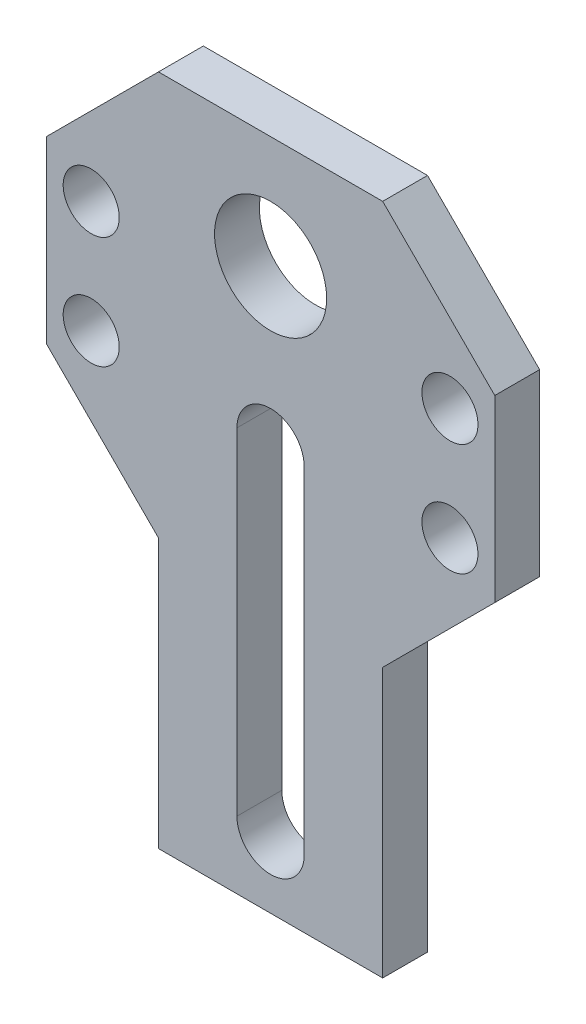
ISO-10303-21;
HEADER;
FILE_DESCRIPTION(('STEP AP214'),'2;1');
FILE_NAME('part.step','',(''),(''),'','','');
FILE_SCHEMA(('AUTOMOTIVE_DESIGN { 1 0 10303 214 1 1 1 1 }'));
ENDSEC;
DATA;
#1=APPLICATION_CONTEXT('core data for automotive mechanical design processes');
#2=APPLICATION_PROTOCOL_DEFINITION('international standard','automotive_design',2000,#1);
#3=PRODUCT_CONTEXT('',#1,'mechanical');
#4=PRODUCT('Part','Part','',(#3));
#5=PRODUCT_RELATED_PRODUCT_CATEGORY('part','',(#4));
#6=PRODUCT_DEFINITION_FORMATION('','',#4);
#7=PRODUCT_DEFINITION_CONTEXT('part definition',#1,'design');
#8=PRODUCT_DEFINITION('design','',#6,#7);
#9=PRODUCT_DEFINITION_SHAPE('','',#8);
#10=(LENGTH_UNIT() NAMED_UNIT(*) SI_UNIT(.MILLI.,.METRE.));
#11=(NAMED_UNIT(*) PLANE_ANGLE_UNIT() SI_UNIT($,.RADIAN.));
#12=(NAMED_UNIT(*) SI_UNIT($,.STERADIAN.) SOLID_ANGLE_UNIT());
#13=UNCERTAINTY_MEASURE_WITH_UNIT(LENGTH_MEASURE(1.E-05),#10,'distance_accuracy_value','');
#14=(GEOMETRIC_REPRESENTATION_CONTEXT(3) GLOBAL_UNCERTAINTY_ASSIGNED_CONTEXT((#13)) GLOBAL_UNIT_ASSIGNED_CONTEXT((#10,
#11,#12)) REPRESENTATION_CONTEXT('',''));
#15=CARTESIAN_POINT('',(0.,0.,0.));
#16=DIRECTION('',(0.,0.,1.));
#17=DIRECTION('',(1.,0.,0.));
#18=AXIS2_PLACEMENT_3D('',#15,#16,#17);
#19=CARTESIAN_POINT('',(0.,0.,2.));
#20=DIRECTION('',(1.,0.,0.));
#21=DIRECTION('',(0.,0.,-1.));
#22=AXIS2_PLACEMENT_3D('',#19,#20,#21);
#23=PLANE('',#22);
#24=DIRECTION('',(0.,0.,1.));
#25=VECTOR('',#24,1.);
#26=CARTESIAN_POINT('',(0.,12.,0.));
#27=LINE('',#26,#25);
#28=CARTESIAN_POINT('',(0.,12.,0.));
#29=VERTEX_POINT('',#28);
#30=CARTESIAN_POINT('',(0.,12.,2.));
#31=VERTEX_POINT('',#30);
#32=EDGE_CURVE('E62',#29,#31,#27,.T.);
#33=ORIENTED_EDGE('',*,*,#32,.F.);
#34=DIRECTION('',(0.,-1.,0.));
#35=VECTOR('',#34,1.);
#36=CARTESIAN_POINT('',(0.,0.,0.));
#37=LINE('',#36,#35);
#38=CARTESIAN_POINT('',(0.,0.,0.));
#39=VERTEX_POINT('',#38);
#40=EDGE_CURVE('E173',#29,#39,#37,.T.);
#41=ORIENTED_EDGE('',*,*,#40,.T.);
#42=DIRECTION('',(0.,0.,-1.));
#43=VECTOR('',#42,1.);
#44=CARTESIAN_POINT('',(0.,0.,2.));
#45=LINE('',#44,#43);
#46=CARTESIAN_POINT('',(0.,0.,2.));
#47=VERTEX_POINT('',#46);
#48=EDGE_CURVE('E11',#47,#39,#45,.T.);
#49=ORIENTED_EDGE('',*,*,#48,.F.);
#50=DIRECTION('',(0.,-1.,0.));
#51=VECTOR('',#50,1.);
#52=CARTESIAN_POINT('',(0.,0.,2.));
#53=LINE('',#52,#51);
#54=EDGE_CURVE('E171',#31,#47,#53,.T.);
#55=ORIENTED_EDGE('',*,*,#54,.F.);
#56=EDGE_LOOP('',(#33,#41,#49,#55));
#57=FACE_BOUND('',#56,.T.);
#58=ADVANCED_FACE('F39',(#57),#23,.F.);
#59=CARTESIAN_POINT('',(0.,0.,2.));
#60=DIRECTION('',(0.,1.,0.));
#61=DIRECTION('',(0.,0.,1.));
#62=AXIS2_PLACEMENT_3D('',#59,#60,#61);
#63=PLANE('',#62);
#64=DIRECTION('',(1.,0.,0.));
#65=VECTOR('',#64,1.);
#66=CARTESIAN_POINT('',(0.,0.,0.));
#67=LINE('',#66,#65);
#68=CARTESIAN_POINT('',(10.,0.,0.));
#69=VERTEX_POINT('',#68);
#70=EDGE_CURVE('E167',#39,#69,#67,.T.);
#71=ORIENTED_EDGE('',*,*,#70,.T.);
#72=DIRECTION('',(0.,0.,-1.));
#73=VECTOR('',#72,1.);
#74=CARTESIAN_POINT('',(10.,0.,2.));
#75=LINE('',#74,#73);
#76=CARTESIAN_POINT('',(10.,0.,2.));
#77=VERTEX_POINT('',#76);
#78=EDGE_CURVE('E47',#77,#69,#75,.T.);
#79=ORIENTED_EDGE('',*,*,#78,.F.);
#80=DIRECTION('',(1.,0.,0.));
#81=VECTOR('',#80,1.);
#82=CARTESIAN_POINT('',(0.,0.,2.));
#83=LINE('',#82,#81);
#84=EDGE_CURVE('E191',#47,#77,#83,.T.);
#85=ORIENTED_EDGE('',*,*,#84,.F.);
#86=ORIENTED_EDGE('',*,*,#48,.T.);
#87=EDGE_LOOP('',(#71,#79,#85,#86));
#88=FACE_BOUND('',#87,.T.);
#89=ADVANCED_FACE('F379',(#88),#63,.F.);
#90=CARTESIAN_POINT('',(10.,0.,2.));
#91=DIRECTION('',(-1.,0.,0.));
#92=DIRECTION('',(0.,0.,1.));
#93=AXIS2_PLACEMENT_3D('',#90,#91,#92);
#94=PLANE('',#93);
#95=DIRECTION('',(0.,1.,0.));
#96=VECTOR('',#95,1.);
#97=CARTESIAN_POINT('',(10.,0.,0.));
#98=LINE('',#97,#96);
#99=CARTESIAN_POINT('',(10.,12.,0.));
#100=VERTEX_POINT('',#99);
#101=EDGE_CURVE('E155',#69,#100,#98,.T.);
#102=ORIENTED_EDGE('',*,*,#101,.T.);
#103=DIRECTION('',(0.,0.,1.));
#104=VECTOR('',#103,1.);
#105=CARTESIAN_POINT('',(10.,12.,0.));
#106=LINE('',#105,#104);
#107=CARTESIAN_POINT('',(10.,12.,2.));
#108=VERTEX_POINT('',#107);
#109=EDGE_CURVE('E138',#100,#108,#106,.T.);
#110=ORIENTED_EDGE('',*,*,#109,.T.);
#111=DIRECTION('',(0.,1.,0.));
#112=VECTOR('',#111,1.);
#113=CARTESIAN_POINT('',(10.,0.,2.));
#114=LINE('',#113,#112);
#115=EDGE_CURVE('E188',#77,#108,#114,.T.);
#116=ORIENTED_EDGE('',*,*,#115,.F.);
#117=ORIENTED_EDGE('',*,*,#78,.T.);
#118=EDGE_LOOP('',(#102,#110,#116,#117));
#119=FACE_BOUND('',#118,.T.);
#120=ADVANCED_FACE('F163',(#119),#94,.F.);
#121=CARTESIAN_POINT('',(0.,30.,2.));
#122=DIRECTION('',(0.,-1.,0.));
#123=DIRECTION('',(0.,0.,-1.));
#124=AXIS2_PLACEMENT_3D('',#121,#122,#123);
#125=PLANE('',#124);
#126=DIRECTION('',(-1.,0.,0.));
#127=VECTOR('',#126,1.);
#128=CARTESIAN_POINT('',(0.,30.,0.));
#129=LINE('',#128,#127);
#130=CARTESIAN_POINT('',(10.,30.,0.));
#131=VERTEX_POINT('',#130);
#132=CARTESIAN_POINT('',(0.,30.,0.));
#133=VERTEX_POINT('',#132);
#134=EDGE_CURVE('E166',#131,#133,#129,.T.);
#135=ORIENTED_EDGE('',*,*,#134,.T.);
#136=DIRECTION('',(0.,0.,-1.));
#137=VECTOR('',#136,1.);
#138=CARTESIAN_POINT('',(0.,30.,2.));
#139=LINE('',#138,#137);
#140=CARTESIAN_POINT('',(0.,30.,2.));
#141=VERTEX_POINT('',#140);
#142=EDGE_CURVE('E177',#141,#133,#139,.T.);
#143=ORIENTED_EDGE('',*,*,#142,.F.);
#144=DIRECTION('',(-1.,0.,0.));
#145=VECTOR('',#144,1.);
#146=CARTESIAN_POINT('',(0.,30.,2.));
#147=LINE('',#146,#145);
#148=CARTESIAN_POINT('',(10.,30.,2.));
#149=VERTEX_POINT('',#148);
#150=EDGE_CURVE('E182',#149,#141,#147,.T.);
#151=ORIENTED_EDGE('',*,*,#150,.F.);
#152=DIRECTION('',(0.,0.,-1.));
#153=VECTOR('',#152,1.);
#154=CARTESIAN_POINT('',(10.,30.,2.));
#155=LINE('',#154,#153);
#156=EDGE_CURVE('E181',#149,#131,#155,.T.);
#157=ORIENTED_EDGE('',*,*,#156,.T.);
#158=EDGE_LOOP('',(#135,#143,#151,#157));
#159=FACE_BOUND('',#158,.T.);
#160=ADVANCED_FACE('F351',(#159),#125,.F.);
#161=CARTESIAN_POINT('',(0.,0.,2.));
#162=DIRECTION('',(0.,0.,-1.));
#163=DIRECTION('',(-1.,0.,0.));
#164=AXIS2_PLACEMENT_3D('',#161,#162,#163);
#165=PLANE('',#164);
#166=CARTESIAN_POINT('',(13.,23.5,2.));
#167=DIRECTION('',(0.,0.,1.));
#168=DIRECTION('',(-1.,0.,0.));
#169=AXIS2_PLACEMENT_3D('',#166,#167,#168);
#170=CIRCLE('',#169,1.25);
#171=CARTESIAN_POINT('',(11.75,23.5,2.));
#172=VERTEX_POINT('',#171);
#173=EDGE_CURVE('E314',#172,#172,#170,.T.);
#174=ORIENTED_EDGE('',*,*,#173,.F.);
#175=EDGE_LOOP('',(#174));
#176=FACE_BOUND('',#175,.T.);
#177=CARTESIAN_POINT('',(13.,18.5,2.));
#178=DIRECTION('',(0.,0.,1.));
#179=DIRECTION('',(-1.,0.,0.));
#180=AXIS2_PLACEMENT_3D('',#177,#178,#179);
#181=CIRCLE('',#180,1.25);
#182=CARTESIAN_POINT('',(11.75,18.5,2.));
#183=VERTEX_POINT('',#182);
#184=EDGE_CURVE('E322',#183,#183,#181,.T.);
#185=ORIENTED_EDGE('',*,*,#184,.F.);
#186=EDGE_LOOP('',(#185));
#187=FACE_BOUND('',#186,.T.);
#188=CARTESIAN_POINT('',(-3.,18.5,2.));
#189=DIRECTION('',(0.,0.,1.));
#190=DIRECTION('',(1.,0.,0.));
#191=AXIS2_PLACEMENT_3D('',#188,#189,#190);
#192=CIRCLE('',#191,1.25);
#193=CARTESIAN_POINT('',(-1.75,18.5,2.));
#194=VERTEX_POINT('',#193);
#195=EDGE_CURVE('E330',#194,#194,#192,.T.);
#196=ORIENTED_EDGE('',*,*,#195,.F.);
#197=EDGE_LOOP('',(#196));
#198=FACE_BOUND('',#197,.T.);
#199=CARTESIAN_POINT('',(-3.,23.5,2.));
#200=DIRECTION('',(0.,0.,1.));
#201=DIRECTION('',(1.,0.,0.));
#202=AXIS2_PLACEMENT_3D('',#199,#200,#201);
#203=CIRCLE('',#202,1.25);
#204=CARTESIAN_POINT('',(-1.75,23.5,2.));
#205=VERTEX_POINT('',#204);
#206=EDGE_CURVE('E306',#205,#205,#203,.T.);
#207=ORIENTED_EDGE('',*,*,#206,.F.);
#208=EDGE_LOOP('',(#207));
#209=FACE_BOUND('',#208,.T.);
#210=DIRECTION('',(0.,1.,0.));
#211=VECTOR('',#210,1.);
#212=CARTESIAN_POINT('',(6.5,3.,2.));
#213=LINE('',#212,#211);
#214=CARTESIAN_POINT('',(6.5,3.,2.));
#215=VERTEX_POINT('',#214);
#216=CARTESIAN_POINT('',(6.5,18.,2.));
#217=VERTEX_POINT('',#216);
#218=EDGE_CURVE('E235',#215,#217,#213,.T.);
#219=ORIENTED_EDGE('',*,*,#218,.F.);
#220=CARTESIAN_POINT('',(5.,3.,2.));
#221=DIRECTION('',(0.,0.,1.));
#222=DIRECTION('',(1.,0.,0.));
#223=AXIS2_PLACEMENT_3D('',#220,#221,#222);
#224=CIRCLE('',#223,1.5);
#225=CARTESIAN_POINT('',(3.5,3.,2.));
#226=VERTEX_POINT('',#225);
#227=EDGE_CURVE('E239',#226,#215,#224,.T.);
#228=ORIENTED_EDGE('',*,*,#227,.F.);
#229=DIRECTION('',(0.,-1.,0.));
#230=VECTOR('',#229,1.);
#231=CARTESIAN_POINT('',(3.5,3.,2.));
#232=LINE('',#231,#230);
#233=CARTESIAN_POINT('',(3.5,18.,2.));
#234=VERTEX_POINT('',#233);
#235=EDGE_CURVE('E226',#234,#226,#232,.T.);
#236=ORIENTED_EDGE('',*,*,#235,.F.);
#237=CARTESIAN_POINT('',(5.,18.,2.));
#238=DIRECTION('',(0.,0.,1.));
#239=DIRECTION('',(1.,0.,0.));
#240=AXIS2_PLACEMENT_3D('',#237,#238,#239);
#241=CIRCLE('',#240,1.5);
#242=EDGE_CURVE('E231',#217,#234,#241,.T.);
#243=ORIENTED_EDGE('',*,*,#242,.F.);
#244=EDGE_LOOP('',(#219,#228,#236,#243));
#245=FACE_BOUND('',#244,.T.);
#246=CARTESIAN_POINT('',(5.,25.,2.));
#247=DIRECTION('',(0.,0.,1.));
#248=DIRECTION('',(1.,0.,0.));
#249=AXIS2_PLACEMENT_3D('',#246,#247,#248);
#250=CIRCLE('',#249,2.5);
#251=CARTESIAN_POINT('',(7.5,25.,2.));
#252=VERTEX_POINT('',#251);
#253=EDGE_CURVE('E200',#252,#252,#250,.T.);
#254=ORIENTED_EDGE('',*,*,#253,.F.);
#255=EDGE_LOOP('',(#254));
#256=FACE_BOUND('',#255,.T.);
#257=ORIENTED_EDGE('',*,*,#150,.T.);
#258=DIRECTION('',(-0.707106781186549,-0.707106781186546,0.));
#259=VECTOR('',#258,1.);
#260=CARTESIAN_POINT('',(0.,30.,2.));
#261=LINE('',#260,#259);
#262=CARTESIAN_POINT('',(-5.,25.,2.));
#263=VERTEX_POINT('',#262);
#264=EDGE_CURVE('E273',#141,#263,#261,.T.);
#265=ORIENTED_EDGE('',*,*,#264,.T.);
#266=DIRECTION('',(0.,-1.,0.));
#267=VECTOR('',#266,1.);
#268=CARTESIAN_POINT('',(-5.,25.,2.));
#269=LINE('',#268,#267);
#270=CARTESIAN_POINT('',(-5.,17.,2.));
#271=VERTEX_POINT('',#270);
#272=EDGE_CURVE('E269',#263,#271,#269,.T.);
#273=ORIENTED_EDGE('',*,*,#272,.T.);
#274=DIRECTION('',(0.707106781186549,-0.707106781186546,0.));
#275=VECTOR('',#274,1.);
#276=CARTESIAN_POINT('',(-5.,17.,2.));
#277=LINE('',#276,#275);
#278=EDGE_CURVE('E265',#271,#31,#277,.T.);
#279=ORIENTED_EDGE('',*,*,#278,.T.);
#280=ORIENTED_EDGE('',*,*,#54,.T.);
#281=ORIENTED_EDGE('',*,*,#84,.T.);
#282=ORIENTED_EDGE('',*,*,#115,.T.);
#283=DIRECTION('',(0.707106781186548,0.707106781186547,0.));
#284=VECTOR('',#283,1.);
#285=CARTESIAN_POINT('',(15.,17.,2.));
#286=LINE('',#285,#284);
#287=CARTESIAN_POINT('',(15.,17.,2.));
#288=VERTEX_POINT('',#287);
#289=EDGE_CURVE('E54',#108,#288,#286,.T.);
#290=ORIENTED_EDGE('',*,*,#289,.T.);
#291=DIRECTION('',(0.,1.,0.));
#292=VECTOR('',#291,1.);
#293=CARTESIAN_POINT('',(15.,25.,2.));
#294=LINE('',#293,#292);
#295=CARTESIAN_POINT('',(15.,25.,2.));
#296=VERTEX_POINT('',#295);
#297=EDGE_CURVE('E295',#288,#296,#294,.T.);
#298=ORIENTED_EDGE('',*,*,#297,.T.);
#299=DIRECTION('',(-0.707106781186549,0.707106781186546,0.));
#300=VECTOR('',#299,1.);
#301=CARTESIAN_POINT('',(10.,30.,2.));
#302=LINE('',#301,#300);
#303=EDGE_CURVE('E160',#296,#149,#302,.T.);
#304=ORIENTED_EDGE('',*,*,#303,.T.);
#305=EDGE_LOOP('',(#257,#265,#273,#279,#280,#281,#282,#290,#298,#304));
#306=FACE_BOUND('',#305,.T.);
#307=ADVANCED_FACE('F348',(#176,#187,#198,#209,#245,#256,#306),#165,.F.);
#308=CARTESIAN_POINT('',(0.,0.,0.));
#309=DIRECTION('',(0.,0.,-1.));
#310=DIRECTION('',(-1.,0.,0.));
#311=AXIS2_PLACEMENT_3D('',#308,#309,#310);
#312=PLANE('',#311);
#313=CARTESIAN_POINT('',(13.,23.5,0.));
#314=DIRECTION('',(0.,0.,1.));
#315=DIRECTION('',(-1.,0.,0.));
#316=AXIS2_PLACEMENT_3D('',#313,#314,#315);
#317=CIRCLE('',#316,1.25);
#318=CARTESIAN_POINT('',(11.75,23.5,0.));
#319=VERTEX_POINT('',#318);
#320=EDGE_CURVE('E318',#319,#319,#317,.T.);
#321=ORIENTED_EDGE('',*,*,#320,.T.);
#322=EDGE_LOOP('',(#321));
#323=FACE_BOUND('',#322,.T.);
#324=CARTESIAN_POINT('',(13.,18.5,0.));
#325=DIRECTION('',(0.,0.,1.));
#326=DIRECTION('',(-1.,0.,0.));
#327=AXIS2_PLACEMENT_3D('',#324,#325,#326);
#328=CIRCLE('',#327,1.25);
#329=CARTESIAN_POINT('',(11.75,18.5,0.));
#330=VERTEX_POINT('',#329);
#331=EDGE_CURVE('E326',#330,#330,#328,.T.);
#332=ORIENTED_EDGE('',*,*,#331,.T.);
#333=EDGE_LOOP('',(#332));
#334=FACE_BOUND('',#333,.T.);
#335=CARTESIAN_POINT('',(-3.,18.5,0.));
#336=DIRECTION('',(0.,0.,1.));
#337=DIRECTION('',(1.,0.,0.));
#338=AXIS2_PLACEMENT_3D('',#335,#336,#337);
#339=CIRCLE('',#338,1.25);
#340=CARTESIAN_POINT('',(-1.75,18.5,0.));
#341=VERTEX_POINT('',#340);
#342=EDGE_CURVE('E310',#341,#341,#339,.T.);
#343=ORIENTED_EDGE('',*,*,#342,.T.);
#344=EDGE_LOOP('',(#343));
#345=FACE_BOUND('',#344,.T.);
#346=CARTESIAN_POINT('',(-3.,23.5,0.));
#347=DIRECTION('',(0.,0.,1.));
#348=DIRECTION('',(1.,0.,0.));
#349=AXIS2_PLACEMENT_3D('',#346,#347,#348);
#350=CIRCLE('',#349,1.25);
#351=CARTESIAN_POINT('',(-1.75,23.5,0.));
#352=VERTEX_POINT('',#351);
#353=EDGE_CURVE('E301',#352,#352,#350,.T.);
#354=ORIENTED_EDGE('',*,*,#353,.T.);
#355=EDGE_LOOP('',(#354));
#356=FACE_BOUND('',#355,.T.);
#357=CARTESIAN_POINT('',(5.,3.,0.));
#358=DIRECTION('',(0.,0.,1.));
#359=DIRECTION('',(1.,0.,0.));
#360=AXIS2_PLACEMENT_3D('',#357,#358,#359);
#361=CIRCLE('',#360,1.5);
#362=CARTESIAN_POINT('',(3.5,3.,0.));
#363=VERTEX_POINT('',#362);
#364=CARTESIAN_POINT('',(6.5,3.,0.));
#365=VERTEX_POINT('',#364);
#366=EDGE_CURVE('E230',#363,#365,#361,.T.);
#367=ORIENTED_EDGE('',*,*,#366,.T.);
#368=DIRECTION('',(0.,1.,0.));
#369=VECTOR('',#368,1.);
#370=CARTESIAN_POINT('',(6.5,3.,0.));
#371=LINE('',#370,#369);
#372=CARTESIAN_POINT('',(6.5,18.,0.));
#373=VERTEX_POINT('',#372);
#374=EDGE_CURVE('E249',#365,#373,#371,.T.);
#375=ORIENTED_EDGE('',*,*,#374,.T.);
#376=CARTESIAN_POINT('',(5.,18.,0.));
#377=DIRECTION('',(0.,0.,1.));
#378=DIRECTION('',(1.,0.,0.));
#379=AXIS2_PLACEMENT_3D('',#376,#377,#378);
#380=CIRCLE('',#379,1.5);
#381=CARTESIAN_POINT('',(3.5,18.,0.));
#382=VERTEX_POINT('',#381);
#383=EDGE_CURVE('E245',#373,#382,#380,.T.);
#384=ORIENTED_EDGE('',*,*,#383,.T.);
#385=DIRECTION('',(0.,-1.,0.));
#386=VECTOR('',#385,1.);
#387=CARTESIAN_POINT('',(3.5,3.,0.));
#388=LINE('',#387,#386);
#389=EDGE_CURVE('E218',#382,#363,#388,.T.);
#390=ORIENTED_EDGE('',*,*,#389,.T.);
#391=EDGE_LOOP('',(#367,#375,#384,#390));
#392=FACE_BOUND('',#391,.T.);
#393=CARTESIAN_POINT('',(5.,25.,0.));
#394=DIRECTION('',(0.,0.,1.));
#395=DIRECTION('',(1.,0.,0.));
#396=AXIS2_PLACEMENT_3D('',#393,#394,#395);
#397=CIRCLE('',#396,2.5);
#398=CARTESIAN_POINT('',(7.5,25.,0.));
#399=VERTEX_POINT('',#398);
#400=EDGE_CURVE('E203',#399,#399,#397,.T.);
#401=ORIENTED_EDGE('',*,*,#400,.T.);
#402=EDGE_LOOP('',(#401));
#403=FACE_BOUND('',#402,.T.);
#404=ORIENTED_EDGE('',*,*,#40,.F.);
#405=DIRECTION('',(0.707106781186549,-0.707106781186546,0.));
#406=VECTOR('',#405,1.);
#407=CARTESIAN_POINT('',(-5.,17.,0.));
#408=LINE('',#407,#406);
#409=CARTESIAN_POINT('',(-5.,17.,0.));
#410=VERTEX_POINT('',#409);
#411=EDGE_CURVE('E260',#410,#29,#408,.T.);
#412=ORIENTED_EDGE('',*,*,#411,.F.);
#413=DIRECTION('',(0.,-1.,0.));
#414=VECTOR('',#413,1.);
#415=CARTESIAN_POINT('',(-5.,25.,0.));
#416=LINE('',#415,#414);
#417=CARTESIAN_POINT('',(-5.,25.,0.));
#418=VERTEX_POINT('',#417);
#419=EDGE_CURVE('E281',#418,#410,#416,.T.);
#420=ORIENTED_EDGE('',*,*,#419,.F.);
#421=DIRECTION('',(-0.707106781186549,-0.707106781186546,0.));
#422=VECTOR('',#421,1.);
#423=CARTESIAN_POINT('',(0.,30.,0.));
#424=LINE('',#423,#422);
#425=EDGE_CURVE('E268',#133,#418,#424,.T.);
#426=ORIENTED_EDGE('',*,*,#425,.F.);
#427=ORIENTED_EDGE('',*,*,#134,.F.);
#428=DIRECTION('',(-0.707106781186549,0.707106781186546,0.));
#429=VECTOR('',#428,1.);
#430=CARTESIAN_POINT('',(10.,30.,0.));
#431=LINE('',#430,#429);
#432=CARTESIAN_POINT('',(15.,25.,0.));
#433=VERTEX_POINT('',#432);
#434=EDGE_CURVE('E148',#433,#131,#431,.T.);
#435=ORIENTED_EDGE('',*,*,#434,.F.);
#436=DIRECTION('',(0.,1.,0.));
#437=VECTOR('',#436,1.);
#438=CARTESIAN_POINT('',(15.,25.,0.));
#439=LINE('',#438,#437);
#440=CARTESIAN_POINT('',(15.,17.,0.));
#441=VERTEX_POINT('',#440);
#442=EDGE_CURVE('E158',#441,#433,#439,.T.);
#443=ORIENTED_EDGE('',*,*,#442,.F.);
#444=DIRECTION('',(0.707106781186548,0.707106781186547,0.));
#445=VECTOR('',#444,1.);
#446=CARTESIAN_POINT('',(15.,17.,0.));
#447=LINE('',#446,#445);
#448=EDGE_CURVE('E141',#100,#441,#447,.T.);
#449=ORIENTED_EDGE('',*,*,#448,.F.);
#450=ORIENTED_EDGE('',*,*,#101,.F.);
#451=ORIENTED_EDGE('',*,*,#70,.F.);
#452=EDGE_LOOP('',(#404,#412,#420,#426,#427,#435,#443,#449,#450,#451));
#453=FACE_BOUND('',#452,.T.);
#454=ADVANCED_FACE('F153',(#323,#334,#345,#356,#392,#403,#453),#312,.T.);
#455=CARTESIAN_POINT('',(5.,25.,0.));
#456=DIRECTION('',(0.,0.,1.));
#457=DIRECTION('',(1.,0.,0.));
#458=AXIS2_PLACEMENT_3D('',#455,#456,#457);
#459=CYLINDRICAL_SURFACE('',#458,2.5);
#460=ORIENTED_EDGE('',*,*,#400,.F.);
#461=EDGE_LOOP('',(#460));
#462=FACE_BOUND('',#461,.T.);
#463=ORIENTED_EDGE('',*,*,#253,.T.);
#464=EDGE_LOOP('',(#463));
#465=FACE_BOUND('',#464,.T.);
#466=ADVANCED_FACE('F392',(#462,#465),#459,.F.);
#467=CARTESIAN_POINT('',(5.,3.,0.));
#468=DIRECTION('',(0.,0.,1.));
#469=DIRECTION('',(1.,0.,0.));
#470=AXIS2_PLACEMENT_3D('',#467,#468,#469);
#471=CYLINDRICAL_SURFACE('',#470,1.5);
#472=ORIENTED_EDGE('',*,*,#227,.T.);
#473=DIRECTION('',(0.,0.,1.));
#474=VECTOR('',#473,1.);
#475=CARTESIAN_POINT('',(6.5,3.,0.));
#476=LINE('',#475,#474);
#477=EDGE_CURVE('E213',#365,#215,#476,.T.);
#478=ORIENTED_EDGE('',*,*,#477,.F.);
#479=ORIENTED_EDGE('',*,*,#366,.F.);
#480=DIRECTION('',(0.,0.,1.));
#481=VECTOR('',#480,1.);
#482=CARTESIAN_POINT('',(3.5,3.,0.));
#483=LINE('',#482,#481);
#484=EDGE_CURVE('E211',#363,#226,#483,.T.);
#485=ORIENTED_EDGE('',*,*,#484,.T.);
#486=EDGE_LOOP('',(#472,#478,#479,#485));
#487=FACE_BOUND('',#486,.T.);
#488=ADVANCED_FACE('F397',(#487),#471,.F.);
#489=CARTESIAN_POINT('',(3.5,3.,0.));
#490=DIRECTION('',(-1.,0.,0.));
#491=DIRECTION('',(0.,-1.,0.));
#492=AXIS2_PLACEMENT_3D('',#489,#490,#491);
#493=PLANE('',#492);
#494=ORIENTED_EDGE('',*,*,#235,.T.);
#495=ORIENTED_EDGE('',*,*,#484,.F.);
#496=ORIENTED_EDGE('',*,*,#389,.F.);
#497=DIRECTION('',(0.,0.,1.));
#498=VECTOR('',#497,1.);
#499=CARTESIAN_POINT('',(3.5,18.,0.));
#500=LINE('',#499,#498);
#501=EDGE_CURVE('E221',#382,#234,#500,.T.);
#502=ORIENTED_EDGE('',*,*,#501,.T.);
#503=EDGE_LOOP('',(#494,#495,#496,#502));
#504=FACE_BOUND('',#503,.T.);
#505=ADVANCED_FACE('F401',(#504),#493,.F.);
#506=CARTESIAN_POINT('',(5.,18.,0.));
#507=DIRECTION('',(0.,0.,1.));
#508=DIRECTION('',(1.,0.,0.));
#509=AXIS2_PLACEMENT_3D('',#506,#507,#508);
#510=CYLINDRICAL_SURFACE('',#509,1.5);
#511=ORIENTED_EDGE('',*,*,#242,.T.);
#512=ORIENTED_EDGE('',*,*,#501,.F.);
#513=ORIENTED_EDGE('',*,*,#383,.F.);
#514=DIRECTION('',(0.,0.,1.));
#515=VECTOR('',#514,1.);
#516=CARTESIAN_POINT('',(6.5,18.,0.));
#517=LINE('',#516,#515);
#518=EDGE_CURVE('E217',#373,#217,#517,.T.);
#519=ORIENTED_EDGE('',*,*,#518,.T.);
#520=EDGE_LOOP('',(#511,#512,#513,#519));
#521=FACE_BOUND('',#520,.T.);
#522=ADVANCED_FACE('F406',(#521),#510,.F.);
#523=CARTESIAN_POINT('',(6.5,3.,0.));
#524=DIRECTION('',(1.,0.,0.));
#525=DIRECTION('',(0.,0.,-1.));
#526=AXIS2_PLACEMENT_3D('',#523,#524,#525);
#527=PLANE('',#526);
#528=ORIENTED_EDGE('',*,*,#218,.T.);
#529=ORIENTED_EDGE('',*,*,#518,.F.);
#530=ORIENTED_EDGE('',*,*,#374,.F.);
#531=ORIENTED_EDGE('',*,*,#477,.T.);
#532=EDGE_LOOP('',(#528,#529,#530,#531));
#533=FACE_BOUND('',#532,.T.);
#534=ADVANCED_FACE('F403',(#533),#527,.F.);
#535=CARTESIAN_POINT('',(-5.,17.,0.));
#536=DIRECTION('',(-0.707106781186546,-0.707106781186549,0.));
#537=DIRECTION('',(0.707106781186549,-0.707106781186546,0.));
#538=AXIS2_PLACEMENT_3D('',#535,#536,#537);
#539=PLANE('',#538);
#540=ORIENTED_EDGE('',*,*,#278,.F.);
#541=DIRECTION('',(0.,0.,1.));
#542=VECTOR('',#541,1.);
#543=CARTESIAN_POINT('',(-5.,17.,0.));
#544=LINE('',#543,#542);
#545=EDGE_CURVE('E259',#410,#271,#544,.T.);
#546=ORIENTED_EDGE('',*,*,#545,.F.);
#547=ORIENTED_EDGE('',*,*,#411,.T.);
#548=ORIENTED_EDGE('',*,*,#32,.T.);
#549=EDGE_LOOP('',(#540,#546,#547,#548));
#550=FACE_BOUND('',#549,.T.);
#551=ADVANCED_FACE('F376',(#550),#539,.T.);
#552=CARTESIAN_POINT('',(-5.,25.,0.));
#553=DIRECTION('',(-1.,0.,0.));
#554=DIRECTION('',(0.,0.,1.));
#555=AXIS2_PLACEMENT_3D('',#552,#553,#554);
#556=PLANE('',#555);
#557=ORIENTED_EDGE('',*,*,#272,.F.);
#558=DIRECTION('',(0.,0.,1.));
#559=VECTOR('',#558,1.);
#560=CARTESIAN_POINT('',(-5.,25.,0.));
#561=LINE('',#560,#559);
#562=EDGE_CURVE('E256',#418,#263,#561,.T.);
#563=ORIENTED_EDGE('',*,*,#562,.F.);
#564=ORIENTED_EDGE('',*,*,#419,.T.);
#565=ORIENTED_EDGE('',*,*,#545,.T.);
#566=EDGE_LOOP('',(#557,#563,#564,#565));
#567=FACE_BOUND('',#566,.T.);
#568=ADVANCED_FACE('F373',(#567),#556,.T.);
#569=CARTESIAN_POINT('',(0.,30.,0.));
#570=DIRECTION('',(-0.707106781186546,0.707106781186549,0.));
#571=DIRECTION('',(-0.707106781186549,-0.707106781186546,0.));
#572=AXIS2_PLACEMENT_3D('',#569,#570,#571);
#573=PLANE('',#572);
#574=ORIENTED_EDGE('',*,*,#264,.F.);
#575=ORIENTED_EDGE('',*,*,#142,.T.);
#576=ORIENTED_EDGE('',*,*,#425,.T.);
#577=ORIENTED_EDGE('',*,*,#562,.T.);
#578=EDGE_LOOP('',(#574,#575,#576,#577));
#579=FACE_BOUND('',#578,.T.);
#580=ADVANCED_FACE('F369',(#579),#573,.T.);
#581=CARTESIAN_POINT('',(10.,30.,0.));
#582=DIRECTION('',(0.707106781186546,0.707106781186549,0.));
#583=DIRECTION('',(-0.707106781186549,0.707106781186546,0.));
#584=AXIS2_PLACEMENT_3D('',#581,#582,#583);
#585=PLANE('',#584);
#586=ORIENTED_EDGE('',*,*,#303,.F.);
#587=DIRECTION('',(0.,0.,1.));
#588=VECTOR('',#587,1.);
#589=CARTESIAN_POINT('',(15.,25.,0.));
#590=LINE('',#589,#588);
#591=EDGE_CURVE('E277',#433,#296,#590,.T.);
#592=ORIENTED_EDGE('',*,*,#591,.F.);
#593=ORIENTED_EDGE('',*,*,#434,.T.);
#594=ORIENTED_EDGE('',*,*,#156,.F.);
#595=EDGE_LOOP('',(#586,#592,#593,#594));
#596=FACE_BOUND('',#595,.T.);
#597=ADVANCED_FACE('F416',(#596),#585,.T.);
#598=CARTESIAN_POINT('',(15.,25.,0.));
#599=DIRECTION('',(1.,0.,0.));
#600=DIRECTION('',(0.,0.,-1.));
#601=AXIS2_PLACEMENT_3D('',#598,#599,#600);
#602=PLANE('',#601);
#603=ORIENTED_EDGE('',*,*,#297,.F.);
#604=DIRECTION('',(0.,0.,1.));
#605=VECTOR('',#604,1.);
#606=CARTESIAN_POINT('',(15.,17.,0.));
#607=LINE('',#606,#605);
#608=EDGE_CURVE('E147',#441,#288,#607,.T.);
#609=ORIENTED_EDGE('',*,*,#608,.F.);
#610=ORIENTED_EDGE('',*,*,#442,.T.);
#611=ORIENTED_EDGE('',*,*,#591,.T.);
#612=EDGE_LOOP('',(#603,#609,#610,#611));
#613=FACE_BOUND('',#612,.T.);
#614=ADVANCED_FACE('F423',(#613),#602,.T.);
#615=CARTESIAN_POINT('',(15.,17.,0.));
#616=DIRECTION('',(0.707106781186547,-0.707106781186548,0.));
#617=DIRECTION('',(0.707106781186548,0.707106781186547,0.));
#618=AXIS2_PLACEMENT_3D('',#615,#616,#617);
#619=PLANE('',#618);
#620=ORIENTED_EDGE('',*,*,#289,.F.);
#621=ORIENTED_EDGE('',*,*,#109,.F.);
#622=ORIENTED_EDGE('',*,*,#448,.T.);
#623=ORIENTED_EDGE('',*,*,#608,.T.);
#624=EDGE_LOOP('',(#620,#621,#622,#623));
#625=FACE_BOUND('',#624,.T.);
#626=ADVANCED_FACE('F140',(#625),#619,.T.);
#627=CARTESIAN_POINT('',(-3.,23.5,0.));
#628=DIRECTION('',(0.,0.,1.));
#629=DIRECTION('',(1.,0.,0.));
#630=AXIS2_PLACEMENT_3D('',#627,#628,#629);
#631=CYLINDRICAL_SURFACE('',#630,1.25);
#632=ORIENTED_EDGE('',*,*,#353,.F.);
#633=EDGE_LOOP('',(#632));
#634=FACE_BOUND('',#633,.T.);
#635=ORIENTED_EDGE('',*,*,#206,.T.);
#636=EDGE_LOOP('',(#635));
#637=FACE_BOUND('',#636,.T.);
#638=ADVANCED_FACE('F344',(#634,#637),#631,.F.);
#639=CARTESIAN_POINT('',(-3.,18.5,0.));
#640=DIRECTION('',(0.,0.,1.));
#641=DIRECTION('',(1.,0.,0.));
#642=AXIS2_PLACEMENT_3D('',#639,#640,#641);
#643=CYLINDRICAL_SURFACE('',#642,1.25);
#644=ORIENTED_EDGE('',*,*,#342,.F.);
#645=EDGE_LOOP('',(#644));
#646=FACE_BOUND('',#645,.T.);
#647=ORIENTED_EDGE('',*,*,#195,.T.);
#648=EDGE_LOOP('',(#647));
#649=FACE_BOUND('',#648,.T.);
#650=ADVANCED_FACE('F340',(#646,#649),#643,.F.);
#651=CARTESIAN_POINT('',(13.,18.5,0.));
#652=DIRECTION('',(0.,0.,1.));
#653=DIRECTION('',(1.,0.,0.));
#654=AXIS2_PLACEMENT_3D('',#651,#652,#653);
#655=CYLINDRICAL_SURFACE('',#654,1.25);
#656=ORIENTED_EDGE('',*,*,#331,.F.);
#657=EDGE_LOOP('',(#656));
#658=FACE_BOUND('',#657,.T.);
#659=ORIENTED_EDGE('',*,*,#184,.T.);
#660=EDGE_LOOP('',(#659));
#661=FACE_BOUND('',#660,.T.);
#662=ADVANCED_FACE('F343',(#658,#661),#655,.F.);
#663=CARTESIAN_POINT('',(13.,23.5,0.));
#664=DIRECTION('',(0.,0.,1.));
#665=DIRECTION('',(1.,0.,0.));
#666=AXIS2_PLACEMENT_3D('',#663,#664,#665);
#667=CYLINDRICAL_SURFACE('',#666,1.25);
#668=ORIENTED_EDGE('',*,*,#320,.F.);
#669=EDGE_LOOP('',(#668));
#670=FACE_BOUND('',#669,.T.);
#671=ORIENTED_EDGE('',*,*,#173,.T.);
#672=EDGE_LOOP('',(#671));
#673=FACE_BOUND('',#672,.T.);
#674=ADVANCED_FACE('F433',(#670,#673),#667,.F.);
#675=CLOSED_SHELL('',(#58,#89,#120,#160,#307,#454,#466,#488,#505,#522,#534,#551,#568,#580,#597,
#614,#626,#638,#650,#662,#674));
#676=MANIFOLD_SOLID_BREP('B2',#675);
#677=ADVANCED_BREP_SHAPE_REPRESENTATION('',(#18,#676),#14);
#678=SHAPE_DEFINITION_REPRESENTATION(#9,#677);
ENDSEC;
END-ISO-10303-21;
